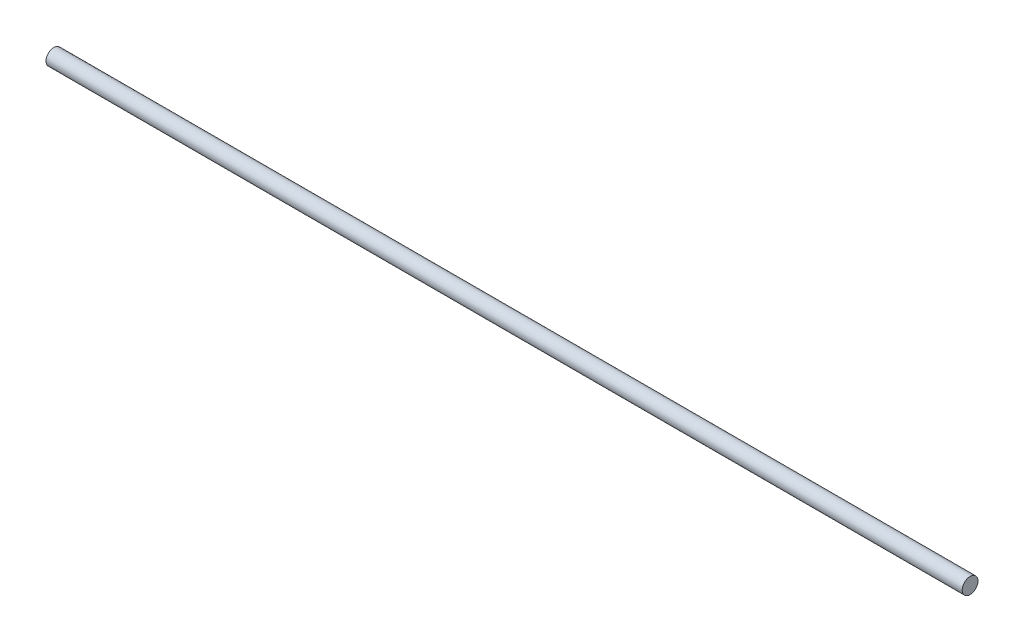
ISO-10303-21;
HEADER;
FILE_DESCRIPTION(('STEP AP214'),'2;1');
FILE_NAME('part.step','',(''),(''),'','','');
FILE_SCHEMA(('AUTOMOTIVE_DESIGN { 1 0 10303 214 1 1 1 1 }'));
ENDSEC;
DATA;
#1=APPLICATION_CONTEXT('core data for automotive mechanical design processes');
#2=APPLICATION_PROTOCOL_DEFINITION('international standard','automotive_design',2000,#1);
#3=PRODUCT_CONTEXT('',#1,'mechanical');
#4=PRODUCT('Part','Part','',(#3));
#5=PRODUCT_RELATED_PRODUCT_CATEGORY('part','',(#4));
#6=PRODUCT_DEFINITION_FORMATION('','',#4);
#7=PRODUCT_DEFINITION_CONTEXT('part definition',#1,'design');
#8=PRODUCT_DEFINITION('design','',#6,#7);
#9=PRODUCT_DEFINITION_SHAPE('','',#8);
#10=(LENGTH_UNIT() NAMED_UNIT(*) SI_UNIT(.MILLI.,.METRE.));
#11=(NAMED_UNIT(*) PLANE_ANGLE_UNIT() SI_UNIT($,.RADIAN.));
#12=(NAMED_UNIT(*) SI_UNIT($,.STERADIAN.) SOLID_ANGLE_UNIT());
#13=UNCERTAINTY_MEASURE_WITH_UNIT(LENGTH_MEASURE(1.E-05),#10,'distance_accuracy_value','');
#14=(GEOMETRIC_REPRESENTATION_CONTEXT(3) GLOBAL_UNCERTAINTY_ASSIGNED_CONTEXT((#13)) GLOBAL_UNIT_ASSIGNED_CONTEXT((#10,
#11,#12)) REPRESENTATION_CONTEXT('',''));
#15=CARTESIAN_POINT('',(0.,0.,0.));
#16=DIRECTION('',(0.,0.,1.));
#17=DIRECTION('',(1.,0.,0.));
#18=AXIS2_PLACEMENT_3D('',#15,#16,#17);
#19=CARTESIAN_POINT('',(580.,0.,0.));
#20=DIRECTION('',(-1.,0.,0.));
#21=DIRECTION('',(0.,0.,1.));
#22=AXIS2_PLACEMENT_3D('',#19,#20,#21);
#23=CYLINDRICAL_SURFACE('',#22,5.);
#24=CARTESIAN_POINT('',(580.,0.,0.));
#25=DIRECTION('',(1.,0.,0.));
#26=DIRECTION('',(0.,0.,-1.));
#27=AXIS2_PLACEMENT_3D('',#24,#25,#26);
#28=CIRCLE('',#27,5.);
#29=CARTESIAN_POINT('',(580.,0.,-5.));
#30=VERTEX_POINT('',#29);
#31=EDGE_CURVE('E10',#30,#30,#28,.T.);
#32=ORIENTED_EDGE('',*,*,#31,.F.);
#33=EDGE_LOOP('',(#32));
#34=FACE_BOUND('',#33,.T.);
#35=CARTESIAN_POINT('',(0.,0.,0.));
#36=DIRECTION('',(1.,0.,0.));
#37=DIRECTION('',(0.,0.,-1.));
#38=AXIS2_PLACEMENT_3D('',#35,#36,#37);
#39=CIRCLE('',#38,5.);
#40=CARTESIAN_POINT('',(0.,0.,-5.));
#41=VERTEX_POINT('',#40);
#42=EDGE_CURVE('E38',#41,#41,#39,.T.);
#43=ORIENTED_EDGE('',*,*,#42,.T.);
#44=EDGE_LOOP('',(#43));
#45=FACE_BOUND('',#44,.T.);
#46=ADVANCED_FACE('F35',(#34,#45),#23,.T.);
#47=CARTESIAN_POINT('',(580.,0.,0.));
#48=DIRECTION('',(1.,0.,0.));
#49=DIRECTION('',(0.,0.,-1.));
#50=AXIS2_PLACEMENT_3D('',#47,#48,#49);
#51=PLANE('',#50);
#52=ORIENTED_EDGE('',*,*,#31,.T.);
#53=EDGE_LOOP('',(#52));
#54=FACE_BOUND('',#53,.T.);
#55=ADVANCED_FACE('F50',(#54),#51,.T.);
#56=CARTESIAN_POINT('',(0.,0.,0.));
#57=DIRECTION('',(1.,0.,0.));
#58=DIRECTION('',(0.,0.,-1.));
#59=AXIS2_PLACEMENT_3D('',#56,#57,#58);
#60=PLANE('',#59);
#61=ORIENTED_EDGE('',*,*,#42,.F.);
#62=EDGE_LOOP('',(#61));
#63=FACE_BOUND('',#62,.T.);
#64=ADVANCED_FACE('F48',(#63),#60,.F.);
#65=CLOSED_SHELL('',(#46,#55,#64));
#66=MANIFOLD_SOLID_BREP('B2',#65);
#67=ADVANCED_BREP_SHAPE_REPRESENTATION('',(#18,#66),#14);
#68=SHAPE_DEFINITION_REPRESENTATION(#9,#67);
ENDSEC;
END-ISO-10303-21;
